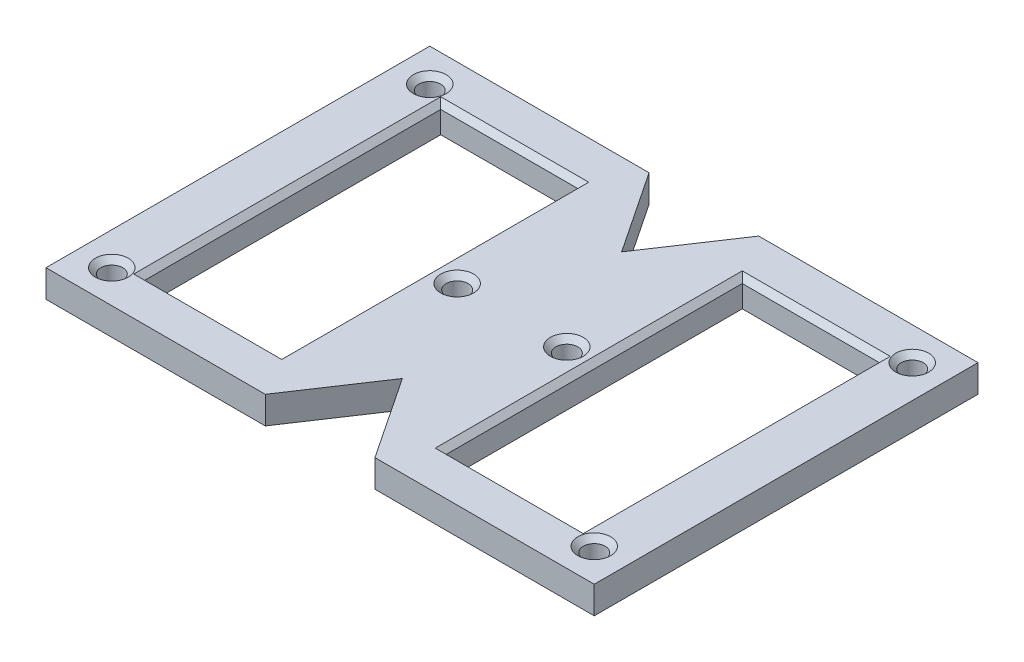
ISO-10303-21;
HEADER;
FILE_DESCRIPTION(('STEP AP214'),'2;1');
FILE_NAME('part.step','',(''),(''),'','','');
FILE_SCHEMA(('AUTOMOTIVE_DESIGN { 1 0 10303 214 1 1 1 1 }'));
ENDSEC;
DATA;
#1=APPLICATION_CONTEXT('core data for automotive mechanical design processes');
#2=APPLICATION_PROTOCOL_DEFINITION('international standard','automotive_design',2000,#1);
#3=PRODUCT_CONTEXT('',#1,'mechanical');
#4=PRODUCT('Part','Part','',(#3));
#5=PRODUCT_RELATED_PRODUCT_CATEGORY('part','',(#4));
#6=PRODUCT_DEFINITION_FORMATION('','',#4);
#7=PRODUCT_DEFINITION_CONTEXT('part definition',#1,'design');
#8=PRODUCT_DEFINITION('design','',#6,#7);
#9=PRODUCT_DEFINITION_SHAPE('','',#8);
#10=(LENGTH_UNIT() NAMED_UNIT(*) SI_UNIT(.MILLI.,.METRE.));
#11=(NAMED_UNIT(*) PLANE_ANGLE_UNIT() SI_UNIT($,.RADIAN.));
#12=(NAMED_UNIT(*) SI_UNIT($,.STERADIAN.) SOLID_ANGLE_UNIT());
#13=UNCERTAINTY_MEASURE_WITH_UNIT(LENGTH_MEASURE(1.E-05),#10,'distance_accuracy_value','');
#14=(GEOMETRIC_REPRESENTATION_CONTEXT(3) GLOBAL_UNCERTAINTY_ASSIGNED_CONTEXT((#13)) GLOBAL_UNIT_ASSIGNED_CONTEXT((#10,
#11,#12)) REPRESENTATION_CONTEXT('',''));
#15=CARTESIAN_POINT('',(0.,0.,0.));
#16=DIRECTION('',(0.,0.,1.));
#17=DIRECTION('',(1.,0.,0.));
#18=AXIS2_PLACEMENT_3D('',#15,#16,#17);
#19=CARTESIAN_POINT('',(50.,5.,35.));
#20=DIRECTION('',(0.,0.,-1.));
#21=DIRECTION('',(-1.,0.,0.));
#22=AXIS2_PLACEMENT_3D('',#19,#20,#21);
#23=PLANE('',#22);
#24=DIRECTION('',(0.,1.,0.));
#25=VECTOR('',#24,1.);
#26=CARTESIAN_POINT('',(-10.,0.,35.));
#27=LINE('',#26,#25);
#28=CARTESIAN_POINT('',(-10.,0.,35.));
#29=VERTEX_POINT('',#28);
#30=CARTESIAN_POINT('',(-10.,5.,35.));
#31=VERTEX_POINT('',#30);
#32=EDGE_CURVE('E389',#29,#31,#27,.T.);
#33=ORIENTED_EDGE('',*,*,#32,.T.);
#34=DIRECTION('',(1.,0.,0.));
#35=VECTOR('',#34,1.);
#36=CARTESIAN_POINT('',(50.,5.,35.));
#37=LINE('',#36,#35);
#38=CARTESIAN_POINT('',(-50.,5.,35.));
#39=VERTEX_POINT('',#38);
#40=EDGE_CURVE('E363',#39,#31,#37,.T.);
#41=ORIENTED_EDGE('',*,*,#40,.F.);
#42=DIRECTION('',(0.,-1.,0.));
#43=VECTOR('',#42,1.);
#44=CARTESIAN_POINT('',(-50.,5.,35.));
#45=LINE('',#44,#43);
#46=CARTESIAN_POINT('',(-50.,0.,35.));
#47=VERTEX_POINT('',#46);
#48=EDGE_CURVE('E235',#39,#47,#45,.T.);
#49=ORIENTED_EDGE('',*,*,#48,.T.);
#50=DIRECTION('',(1.,0.,0.));
#51=VECTOR('',#50,1.);
#52=CARTESIAN_POINT('',(50.,0.,35.));
#53=LINE('',#52,#51);
#54=EDGE_CURVE('E211',#47,#29,#53,.T.);
#55=ORIENTED_EDGE('',*,*,#54,.T.);
#56=EDGE_LOOP('',(#33,#41,#49,#55));
#57=FACE_BOUND('',#56,.T.);
#58=ADVANCED_FACE('F35',(#57),#23,.F.);
#59=DIRECTION('',(0.,1.,0.));
#60=VECTOR('',#59,1.);
#61=CARTESIAN_POINT('',(10.,0.,35.));
#62=LINE('',#61,#60);
#63=CARTESIAN_POINT('',(10.,0.,35.));
#64=VERTEX_POINT('',#63);
#65=CARTESIAN_POINT('',(10.,5.,35.));
#66=VERTEX_POINT('',#65);
#67=EDGE_CURVE('E189',#64,#66,#62,.T.);
#68=ORIENTED_EDGE('',*,*,#67,.F.);
#69=CARTESIAN_POINT('',(50.,0.,35.));
#70=VERTEX_POINT('',#69);
#71=EDGE_CURVE('E203',#64,#70,#53,.T.);
#72=ORIENTED_EDGE('',*,*,#71,.T.);
#73=DIRECTION('',(0.,-1.,0.));
#74=VECTOR('',#73,1.);
#75=CARTESIAN_POINT('',(50.,5.,35.));
#76=LINE('',#75,#74);
#77=CARTESIAN_POINT('',(50.,5.,35.));
#78=VERTEX_POINT('',#77);
#79=EDGE_CURVE('E233',#78,#70,#76,.T.);
#80=ORIENTED_EDGE('',*,*,#79,.F.);
#81=EDGE_CURVE('E205',#66,#78,#37,.T.);
#82=ORIENTED_EDGE('',*,*,#81,.F.);
#83=EDGE_LOOP('',(#68,#72,#80,#82));
#84=FACE_BOUND('',#83,.T.);
#85=ADVANCED_FACE('F201',(#84),#23,.F.);
#86=CARTESIAN_POINT('',(0.,5.,0.));
#87=DIRECTION('',(0.,1.,0.));
#88=DIRECTION('',(0.,0.,1.));
#89=AXIS2_PLACEMENT_3D('',#86,#87,#88);
#90=PLANE('',#89);
#91=CARTESIAN_POINT('',(44.,5.,29.));
#92=DIRECTION('',(0.,1.,0.));
#93=DIRECTION('',(0.,0.,1.));
#94=AXIS2_PLACEMENT_3D('',#91,#92,#93);
#95=CIRCLE('',#94,3.00000000000004);
#96=CARTESIAN_POINT('',(44.,5.,32.0000000000001));
#97=VERTEX_POINT('',#96);
#98=EDGE_CURVE('E274',#97,#97,#95,.F.);
#99=ORIENTED_EDGE('',*,*,#98,.T.);
#100=EDGE_LOOP('',(#99));
#101=FACE_BOUND('',#100,.T.);
#102=CARTESIAN_POINT('',(44.,5.,-29.));
#103=DIRECTION('',(0.,1.,0.));
#104=DIRECTION('',(0.,0.,1.));
#105=AXIS2_PLACEMENT_3D('',#102,#103,#104);
#106=CIRCLE('',#105,3.00000000000004);
#107=CARTESIAN_POINT('',(44.,5.,-26.));
#108=VERTEX_POINT('',#107);
#109=EDGE_CURVE('E271',#108,#108,#106,.F.);
#110=ORIENTED_EDGE('',*,*,#109,.T.);
#111=EDGE_LOOP('',(#110));
#112=FACE_BOUND('',#111,.T.);
#113=CARTESIAN_POINT('',(10.,5.,0.));
#114=DIRECTION('',(0.,1.,0.));
#115=DIRECTION('',(0.,0.,1.));
#116=AXIS2_PLACEMENT_3D('',#113,#114,#115);
#117=CIRCLE('',#116,3.00000000000004);
#118=CARTESIAN_POINT('',(10.,5.,3.00000000000004));
#119=VERTEX_POINT('',#118);
#120=EDGE_CURVE('E268',#119,#119,#117,.F.);
#121=ORIENTED_EDGE('',*,*,#120,.T.);
#122=EDGE_LOOP('',(#121));
#123=FACE_BOUND('',#122,.T.);
#124=CARTESIAN_POINT('',(-10.,5.,0.));
#125=DIRECTION('',(0.,1.,0.));
#126=DIRECTION('',(0.,0.,1.));
#127=AXIS2_PLACEMENT_3D('',#124,#125,#126);
#128=CIRCLE('',#127,3.00000000000004);
#129=CARTESIAN_POINT('',(-10.,5.,3.00000000000004));
#130=VERTEX_POINT('',#129);
#131=EDGE_CURVE('E265',#130,#130,#128,.F.);
#132=ORIENTED_EDGE('',*,*,#131,.T.);
#133=EDGE_LOOP('',(#132));
#134=FACE_BOUND('',#133,.T.);
#135=CARTESIAN_POINT('',(-44.,5.,29.));
#136=DIRECTION('',(0.,1.,0.));
#137=DIRECTION('',(0.,0.,1.));
#138=AXIS2_PLACEMENT_3D('',#135,#136,#137);
#139=CIRCLE('',#138,3.00000000000004);
#140=CARTESIAN_POINT('',(-44.,5.,32.0000000000001));
#141=VERTEX_POINT('',#140);
#142=EDGE_CURVE('E262',#141,#141,#139,.F.);
#143=ORIENTED_EDGE('',*,*,#142,.T.);
#144=EDGE_LOOP('',(#143));
#145=FACE_BOUND('',#144,.T.);
#146=CARTESIAN_POINT('',(-44.,5.,-29.));
#147=DIRECTION('',(0.,1.,0.));
#148=DIRECTION('',(0.,0.,1.));
#149=AXIS2_PLACEMENT_3D('',#146,#147,#148);
#150=CIRCLE('',#149,3.00000000000004);
#151=CARTESIAN_POINT('',(-44.,5.,-26.));
#152=VERTEX_POINT('',#151);
#153=EDGE_CURVE('E259',#152,#152,#150,.F.);
#154=ORIENTED_EDGE('',*,*,#153,.T.);
#155=EDGE_LOOP('',(#154));
#156=FACE_BOUND('',#155,.T.);
#157=DIRECTION('',(0.,0.,1.));
#158=VECTOR('',#157,1.);
#159=CARTESIAN_POINT('',(41.,5.,27.));
#160=LINE('',#159,#158);
#161=CARTESIAN_POINT('',(41.,5.,-28.));
#162=VERTEX_POINT('',#161);
#163=CARTESIAN_POINT('',(41.,5.,28.));
#164=VERTEX_POINT('',#163);
#165=EDGE_CURVE('E254',#162,#164,#160,.T.);
#166=ORIENTED_EDGE('',*,*,#165,.T.);
#167=DIRECTION('',(-1.,0.,0.));
#168=VECTOR('',#167,1.);
#169=CARTESIAN_POINT('',(15.,5.,28.));
#170=LINE('',#169,#168);
#171=CARTESIAN_POINT('',(14.,5.,28.));
#172=VERTEX_POINT('',#171);
#173=EDGE_CURVE('E256',#164,#172,#170,.T.);
#174=ORIENTED_EDGE('',*,*,#173,.T.);
#175=DIRECTION('',(0.,0.,-1.));
#176=VECTOR('',#175,1.);
#177=CARTESIAN_POINT('',(14.,5.,-27.));
#178=LINE('',#177,#176);
#179=CARTESIAN_POINT('',(14.,5.,-28.));
#180=VERTEX_POINT('',#179);
#181=EDGE_CURVE('E252',#172,#180,#178,.T.);
#182=ORIENTED_EDGE('',*,*,#181,.T.);
#183=DIRECTION('',(1.,0.,0.));
#184=VECTOR('',#183,1.);
#185=CARTESIAN_POINT('',(40.,5.,-28.));
#186=LINE('',#185,#184);
#187=EDGE_CURVE('E250',#180,#162,#186,.T.);
#188=ORIENTED_EDGE('',*,*,#187,.T.);
#189=EDGE_LOOP('',(#166,#174,#182,#188));
#190=FACE_BOUND('',#189,.T.);
#191=DIRECTION('',(0.,0.,1.));
#192=VECTOR('',#191,1.);
#193=CARTESIAN_POINT('',(-14.,5.,27.));
#194=LINE('',#193,#192);
#195=CARTESIAN_POINT('',(-14.,5.,-28.));
#196=VERTEX_POINT('',#195);
#197=CARTESIAN_POINT('',(-14.,5.,28.));
#198=VERTEX_POINT('',#197);
#199=EDGE_CURVE('E245',#196,#198,#194,.T.);
#200=ORIENTED_EDGE('',*,*,#199,.T.);
#201=DIRECTION('',(-1.,0.,0.));
#202=VECTOR('',#201,1.);
#203=CARTESIAN_POINT('',(-40.,5.,28.));
#204=LINE('',#203,#202);
#205=CARTESIAN_POINT('',(-41.,5.,28.));
#206=VERTEX_POINT('',#205);
#207=EDGE_CURVE('E247',#198,#206,#204,.T.);
#208=ORIENTED_EDGE('',*,*,#207,.T.);
#209=DIRECTION('',(0.,0.,-1.));
#210=VECTOR('',#209,1.);
#211=CARTESIAN_POINT('',(-41.,5.,-27.));
#212=LINE('',#211,#210);
#213=CARTESIAN_POINT('',(-41.,5.,-28.));
#214=VERTEX_POINT('',#213);
#215=EDGE_CURVE('E241',#206,#214,#212,.T.);
#216=ORIENTED_EDGE('',*,*,#215,.T.);
#217=DIRECTION('',(1.,0.,0.));
#218=VECTOR('',#217,1.);
#219=CARTESIAN_POINT('',(-15.,5.,-28.));
#220=LINE('',#219,#218);
#221=EDGE_CURVE('E243',#214,#196,#220,.T.);
#222=ORIENTED_EDGE('',*,*,#221,.T.);
#223=EDGE_LOOP('',(#200,#208,#216,#222));
#224=FACE_BOUND('',#223,.T.);
#225=ORIENTED_EDGE('',*,*,#40,.T.);
#226=DIRECTION('',(0.554700196225229,0.,-0.832050294337844));
#227=VECTOR('',#226,1.);
#228=CARTESIAN_POINT('',(-10.,5.,35.));
#229=LINE('',#228,#227);
#230=CARTESIAN_POINT('',(0.,5.,20.));
#231=VERTEX_POINT('',#230);
#232=EDGE_CURVE('E197',#31,#231,#229,.T.);
#233=ORIENTED_EDGE('',*,*,#232,.T.);
#234=DIRECTION('',(0.554700196225229,0.,0.832050294337844));
#235=VECTOR('',#234,1.);
#236=CARTESIAN_POINT('',(0.,5.,20.));
#237=LINE('',#236,#235);
#238=EDGE_CURVE('E316',#231,#66,#237,.T.);
#239=ORIENTED_EDGE('',*,*,#238,.T.);
#240=ORIENTED_EDGE('',*,*,#81,.T.);
#241=DIRECTION('',(0.,0.,-1.));
#242=VECTOR('',#241,1.);
#243=CARTESIAN_POINT('',(50.,5.,35.));
#244=LINE('',#243,#242);
#245=CARTESIAN_POINT('',(50.,5.,-35.));
#246=VERTEX_POINT('',#245);
#247=EDGE_CURVE('E368',#78,#246,#244,.T.);
#248=ORIENTED_EDGE('',*,*,#247,.T.);
#249=DIRECTION('',(-1.,0.,0.));
#250=VECTOR('',#249,1.);
#251=CARTESIAN_POINT('',(50.,5.,-35.));
#252=LINE('',#251,#250);
#253=CARTESIAN_POINT('',(10.,5.,-35.));
#254=VERTEX_POINT('',#253);
#255=EDGE_CURVE('E230',#246,#254,#252,.T.);
#256=ORIENTED_EDGE('',*,*,#255,.T.);
#257=DIRECTION('',(0.554700196225229,0.,-0.832050294337844));
#258=VECTOR('',#257,1.);
#259=CARTESIAN_POINT('',(0.,5.,-20.));
#260=LINE('',#259,#258);
#261=CARTESIAN_POINT('',(0.,5.,-20.));
#262=VERTEX_POINT('',#261);
#263=EDGE_CURVE('E401',#262,#254,#260,.T.);
#264=ORIENTED_EDGE('',*,*,#263,.F.);
#265=DIRECTION('',(0.554700196225229,0.,0.832050294337844));
#266=VECTOR('',#265,1.);
#267=CARTESIAN_POINT('',(-10.,5.,-35.));
#268=LINE('',#267,#266);
#269=CARTESIAN_POINT('',(-10.,5.,-35.));
#270=VERTEX_POINT('',#269);
#271=EDGE_CURVE('E381',#270,#262,#268,.T.);
#272=ORIENTED_EDGE('',*,*,#271,.F.);
#273=CARTESIAN_POINT('',(-50.,5.,-35.));
#274=VERTEX_POINT('',#273);
#275=EDGE_CURVE('E370',#270,#274,#252,.T.);
#276=ORIENTED_EDGE('',*,*,#275,.T.);
#277=DIRECTION('',(0.,0.,1.));
#278=VECTOR('',#277,1.);
#279=CARTESIAN_POINT('',(-50.,5.,35.));
#280=LINE('',#279,#278);
#281=EDGE_CURVE('E225',#274,#39,#280,.T.);
#282=ORIENTED_EDGE('',*,*,#281,.T.);
#283=EDGE_LOOP('',(#225,#233,#239,#240,#248,#256,#264,#272,#276,#282));
#284=FACE_BOUND('',#283,.T.);
#285=ADVANCED_FACE('F355',(#101,#112,#123,#134,#145,#156,#190,#224,#284),#90,.T.);
#286=CARTESIAN_POINT('',(0.,0.,0.));
#287=DIRECTION('',(0.,1.,0.));
#288=DIRECTION('',(0.,0.,1.));
#289=AXIS2_PLACEMENT_3D('',#286,#287,#288);
#290=PLANE('',#289);
#291=CARTESIAN_POINT('',(-44.,0.,-29.));
#292=DIRECTION('',(0.,1.,0.));
#293=DIRECTION('',(0.,0.,1.));
#294=AXIS2_PLACEMENT_3D('',#291,#292,#293);
#295=CIRCLE('',#294,2.);
#296=CARTESIAN_POINT('',(-44.,0.,-27.));
#297=VERTEX_POINT('',#296);
#298=EDGE_CURVE('E216',#297,#297,#295,.T.);
#299=ORIENTED_EDGE('',*,*,#298,.T.);
#300=EDGE_LOOP('',(#299));
#301=FACE_BOUND('',#300,.T.);
#302=CARTESIAN_POINT('',(44.,0.,-29.));
#303=DIRECTION('',(0.,1.,0.));
#304=DIRECTION('',(0.,0.,1.));
#305=AXIS2_PLACEMENT_3D('',#302,#303,#304);
#306=CIRCLE('',#305,2.);
#307=CARTESIAN_POINT('',(44.,0.,-27.));
#308=VERTEX_POINT('',#307);
#309=EDGE_CURVE('E453',#308,#308,#306,.T.);
#310=ORIENTED_EDGE('',*,*,#309,.T.);
#311=EDGE_LOOP('',(#310));
#312=FACE_BOUND('',#311,.T.);
#313=CARTESIAN_POINT('',(44.,0.,29.));
#314=DIRECTION('',(0.,1.,0.));
#315=DIRECTION('',(0.,0.,1.));
#316=AXIS2_PLACEMENT_3D('',#313,#314,#315);
#317=CIRCLE('',#316,2.);
#318=CARTESIAN_POINT('',(44.,0.,31.));
#319=VERTEX_POINT('',#318);
#320=EDGE_CURVE('E456',#319,#319,#317,.T.);
#321=ORIENTED_EDGE('',*,*,#320,.T.);
#322=EDGE_LOOP('',(#321));
#323=FACE_BOUND('',#322,.T.);
#324=CARTESIAN_POINT('',(-44.,0.,29.));
#325=DIRECTION('',(0.,1.,0.));
#326=DIRECTION('',(0.,0.,1.));
#327=AXIS2_PLACEMENT_3D('',#324,#325,#326);
#328=CIRCLE('',#327,2.);
#329=CARTESIAN_POINT('',(-44.,0.,31.));
#330=VERTEX_POINT('',#329);
#331=EDGE_CURVE('E450',#330,#330,#328,.T.);
#332=ORIENTED_EDGE('',*,*,#331,.T.);
#333=EDGE_LOOP('',(#332));
#334=FACE_BOUND('',#333,.T.);
#335=CARTESIAN_POINT('',(10.,0.,0.));
#336=DIRECTION('',(0.,1.,0.));
#337=DIRECTION('',(0.,0.,1.));
#338=AXIS2_PLACEMENT_3D('',#335,#336,#337);
#339=CIRCLE('',#338,2.);
#340=CARTESIAN_POINT('',(10.,0.,2.));
#341=VERTEX_POINT('',#340);
#342=EDGE_CURVE('E426',#341,#341,#339,.T.);
#343=ORIENTED_EDGE('',*,*,#342,.T.);
#344=EDGE_LOOP('',(#343));
#345=FACE_BOUND('',#344,.T.);
#346=CARTESIAN_POINT('',(-10.,0.,0.));
#347=DIRECTION('',(0.,1.,0.));
#348=DIRECTION('',(0.,0.,1.));
#349=AXIS2_PLACEMENT_3D('',#346,#347,#348);
#350=CIRCLE('',#349,2.);
#351=CARTESIAN_POINT('',(-10.,0.,2.));
#352=VERTEX_POINT('',#351);
#353=EDGE_CURVE('E447',#352,#352,#350,.T.);
#354=ORIENTED_EDGE('',*,*,#353,.T.);
#355=EDGE_LOOP('',(#354));
#356=FACE_BOUND('',#355,.T.);
#357=DIRECTION('',(-1.,0.,0.));
#358=VECTOR('',#357,1.);
#359=CARTESIAN_POINT('',(15.,0.,27.));
#360=LINE('',#359,#358);
#361=CARTESIAN_POINT('',(40.,0.,27.));
#362=VERTEX_POINT('',#361);
#363=CARTESIAN_POINT('',(15.,0.,27.));
#364=VERTEX_POINT('',#363);
#365=EDGE_CURVE('E431',#362,#364,#360,.T.);
#366=ORIENTED_EDGE('',*,*,#365,.F.);
#367=DIRECTION('',(0.,0.,1.));
#368=VECTOR('',#367,1.);
#369=CARTESIAN_POINT('',(40.,0.,-27.));
#370=LINE('',#369,#368);
#371=CARTESIAN_POINT('',(40.,0.,-27.));
#372=VERTEX_POINT('',#371);
#373=EDGE_CURVE('E410',#372,#362,#370,.T.);
#374=ORIENTED_EDGE('',*,*,#373,.F.);
#375=DIRECTION('',(1.,0.,0.));
#376=VECTOR('',#375,1.);
#377=CARTESIAN_POINT('',(15.,0.,-27.));
#378=LINE('',#377,#376);
#379=CARTESIAN_POINT('',(15.,0.,-27.));
#380=VERTEX_POINT('',#379);
#381=EDGE_CURVE('E437',#380,#372,#378,.T.);
#382=ORIENTED_EDGE('',*,*,#381,.F.);
#383=DIRECTION('',(0.,0.,-1.));
#384=VECTOR('',#383,1.);
#385=CARTESIAN_POINT('',(15.,0.,-27.));
#386=LINE('',#385,#384);
#387=EDGE_CURVE('E434',#364,#380,#386,.T.);
#388=ORIENTED_EDGE('',*,*,#387,.F.);
#389=EDGE_LOOP('',(#366,#374,#382,#388));
#390=FACE_BOUND('',#389,.T.);
#391=DIRECTION('',(-1.,0.,0.));
#392=VECTOR('',#391,1.);
#393=CARTESIAN_POINT('',(-40.,0.,27.));
#394=LINE('',#393,#392);
#395=CARTESIAN_POINT('',(-15.,0.,27.));
#396=VERTEX_POINT('',#395);
#397=CARTESIAN_POINT('',(-40.,0.,27.));
#398=VERTEX_POINT('',#397);
#399=EDGE_CURVE('E347',#396,#398,#394,.T.);
#400=ORIENTED_EDGE('',*,*,#399,.F.);
#401=DIRECTION('',(0.,0.,1.));
#402=VECTOR('',#401,1.);
#403=CARTESIAN_POINT('',(-15.,0.,-27.));
#404=LINE('',#403,#402);
#405=CARTESIAN_POINT('',(-15.,0.,-27.));
#406=VERTEX_POINT('',#405);
#407=EDGE_CURVE('E414',#406,#396,#404,.T.);
#408=ORIENTED_EDGE('',*,*,#407,.F.);
#409=DIRECTION('',(1.,0.,0.));
#410=VECTOR('',#409,1.);
#411=CARTESIAN_POINT('',(-40.,0.,-27.));
#412=LINE('',#411,#410);
#413=CARTESIAN_POINT('',(-40.,0.,-27.));
#414=VERTEX_POINT('',#413);
#415=EDGE_CURVE('E421',#414,#406,#412,.T.);
#416=ORIENTED_EDGE('',*,*,#415,.F.);
#417=DIRECTION('',(0.,0.,-1.));
#418=VECTOR('',#417,1.);
#419=CARTESIAN_POINT('',(-40.,0.,-27.));
#420=LINE('',#419,#418);
#421=EDGE_CURVE('E419',#398,#414,#420,.T.);
#422=ORIENTED_EDGE('',*,*,#421,.F.);
#423=EDGE_LOOP('',(#400,#408,#416,#422));
#424=FACE_BOUND('',#423,.T.);
#425=DIRECTION('',(0.554700196225229,0.,-0.832050294337844));
#426=VECTOR('',#425,1.);
#427=CARTESIAN_POINT('',(-10.,0.,35.));
#428=LINE('',#427,#426);
#429=CARTESIAN_POINT('',(0.,0.,20.));
#430=VERTEX_POINT('',#429);
#431=EDGE_CURVE('E196',#29,#430,#428,.T.);
#432=ORIENTED_EDGE('',*,*,#431,.F.);
#433=ORIENTED_EDGE('',*,*,#54,.F.);
#434=DIRECTION('',(0.,0.,1.));
#435=VECTOR('',#434,1.);
#436=CARTESIAN_POINT('',(-50.,0.,35.));
#437=LINE('',#436,#435);
#438=CARTESIAN_POINT('',(-50.,0.,-35.));
#439=VERTEX_POINT('',#438);
#440=EDGE_CURVE('E212',#439,#47,#437,.T.);
#441=ORIENTED_EDGE('',*,*,#440,.F.);
#442=DIRECTION('',(-1.,0.,0.));
#443=VECTOR('',#442,1.);
#444=CARTESIAN_POINT('',(50.,0.,-35.));
#445=LINE('',#444,#443);
#446=CARTESIAN_POINT('',(-10.,0.,-35.));
#447=VERTEX_POINT('',#446);
#448=EDGE_CURVE('E221',#447,#439,#445,.T.);
#449=ORIENTED_EDGE('',*,*,#448,.F.);
#450=DIRECTION('',(0.554700196225229,0.,0.832050294337844));
#451=VECTOR('',#450,1.);
#452=CARTESIAN_POINT('',(-10.,0.,-35.));
#453=LINE('',#452,#451);
#454=CARTESIAN_POINT('',(0.,0.,-20.));
#455=VERTEX_POINT('',#454);
#456=EDGE_CURVE('E397',#447,#455,#453,.T.);
#457=ORIENTED_EDGE('',*,*,#456,.T.);
#458=DIRECTION('',(0.554700196225229,0.,-0.832050294337844));
#459=VECTOR('',#458,1.);
#460=CARTESIAN_POINT('',(0.,0.,-20.));
#461=LINE('',#460,#459);
#462=CARTESIAN_POINT('',(10.,0.,-35.));
#463=VERTEX_POINT('',#462);
#464=EDGE_CURVE('E400',#455,#463,#461,.T.);
#465=ORIENTED_EDGE('',*,*,#464,.T.);
#466=CARTESIAN_POINT('',(50.,0.,-35.));
#467=VERTEX_POINT('',#466);
#468=EDGE_CURVE('E222',#467,#463,#445,.T.);
#469=ORIENTED_EDGE('',*,*,#468,.F.);
#470=DIRECTION('',(0.,0.,-1.));
#471=VECTOR('',#470,1.);
#472=CARTESIAN_POINT('',(50.,0.,35.));
#473=LINE('',#472,#471);
#474=EDGE_CURVE('E210',#70,#467,#473,.T.);
#475=ORIENTED_EDGE('',*,*,#474,.F.);
#476=ORIENTED_EDGE('',*,*,#71,.F.);
#477=DIRECTION('',(0.554700196225229,0.,0.832050294337844));
#478=VECTOR('',#477,1.);
#479=CARTESIAN_POINT('',(0.,0.,20.));
#480=LINE('',#479,#478);
#481=EDGE_CURVE('E185',#430,#64,#480,.T.);
#482=ORIENTED_EDGE('',*,*,#481,.F.);
#483=EDGE_LOOP('',(#432,#433,#441,#449,#457,#465,#469,#475,#476,#482));
#484=FACE_BOUND('',#483,.T.);
#485=ADVANCED_FACE('F208',(#301,#312,#323,#334,#345,#356,#390,#424,#484),#290,.F.);
#486=CARTESIAN_POINT('',(50.,5.,-35.));
#487=DIRECTION('',(0.,0.,1.));
#488=DIRECTION('',(1.,0.,0.));
#489=AXIS2_PLACEMENT_3D('',#486,#487,#488);
#490=PLANE('',#489);
#491=ORIENTED_EDGE('',*,*,#468,.T.);
#492=DIRECTION('',(0.,1.,0.));
#493=VECTOR('',#492,1.);
#494=CARTESIAN_POINT('',(10.,0.,-35.));
#495=LINE('',#494,#493);
#496=EDGE_CURVE('E407',#463,#254,#495,.T.);
#497=ORIENTED_EDGE('',*,*,#496,.T.);
#498=ORIENTED_EDGE('',*,*,#255,.F.);
#499=DIRECTION('',(0.,-1.,0.));
#500=VECTOR('',#499,1.);
#501=CARTESIAN_POINT('',(50.,5.,-35.));
#502=LINE('',#501,#500);
#503=EDGE_CURVE('E229',#246,#467,#502,.T.);
#504=ORIENTED_EDGE('',*,*,#503,.T.);
#505=EDGE_LOOP('',(#491,#497,#498,#504));
#506=FACE_BOUND('',#505,.T.);
#507=ADVANCED_FACE('F479',(#506),#490,.F.);
#508=CARTESIAN_POINT('',(-50.,5.,35.));
#509=DIRECTION('',(1.,0.,0.));
#510=DIRECTION('',(0.,0.,-1.));
#511=AXIS2_PLACEMENT_3D('',#508,#509,#510);
#512=PLANE('',#511);
#513=ORIENTED_EDGE('',*,*,#440,.T.);
#514=ORIENTED_EDGE('',*,*,#48,.F.);
#515=ORIENTED_EDGE('',*,*,#281,.F.);
#516=DIRECTION('',(0.,-1.,0.));
#517=VECTOR('',#516,1.);
#518=CARTESIAN_POINT('',(-50.,5.,-35.));
#519=LINE('',#518,#517);
#520=EDGE_CURVE('E226',#274,#439,#519,.T.);
#521=ORIENTED_EDGE('',*,*,#520,.T.);
#522=EDGE_LOOP('',(#513,#514,#515,#521));
#523=FACE_BOUND('',#522,.T.);
#524=ADVANCED_FACE('F388',(#523),#512,.F.);
#525=CARTESIAN_POINT('',(50.,5.,35.));
#526=DIRECTION('',(-1.,0.,0.));
#527=DIRECTION('',(0.,0.,1.));
#528=AXIS2_PLACEMENT_3D('',#525,#526,#527);
#529=PLANE('',#528);
#530=ORIENTED_EDGE('',*,*,#474,.T.);
#531=ORIENTED_EDGE('',*,*,#503,.F.);
#532=ORIENTED_EDGE('',*,*,#247,.F.);
#533=ORIENTED_EDGE('',*,*,#79,.T.);
#534=EDGE_LOOP('',(#530,#531,#532,#533));
#535=FACE_BOUND('',#534,.T.);
#536=ADVANCED_FACE('F477',(#535),#529,.F.);
#537=ORIENTED_EDGE('',*,*,#275,.F.);
#538=DIRECTION('',(0.,1.,0.));
#539=VECTOR('',#538,1.);
#540=CARTESIAN_POINT('',(-10.,0.,-35.));
#541=LINE('',#540,#539);
#542=EDGE_CURVE('E404',#447,#270,#541,.T.);
#543=ORIENTED_EDGE('',*,*,#542,.F.);
#544=ORIENTED_EDGE('',*,*,#448,.T.);
#545=ORIENTED_EDGE('',*,*,#520,.F.);
#546=EDGE_LOOP('',(#537,#543,#544,#545));
#547=FACE_BOUND('',#546,.T.);
#548=ADVANCED_FACE('F384',(#547),#490,.F.);
#549=CARTESIAN_POINT('',(-44.,0.,-29.));
#550=DIRECTION('',(0.,1.,0.));
#551=DIRECTION('',(0.,0.,1.));
#552=AXIS2_PLACEMENT_3D('',#549,#550,#551);
#553=CYLINDRICAL_SURFACE('',#552,2.);
#554=CARTESIAN_POINT('',(-44.,3.99999999999997,-29.));
#555=DIRECTION('',(0.,1.,0.));
#556=DIRECTION('',(0.,0.,1.));
#557=AXIS2_PLACEMENT_3D('',#554,#555,#556);
#558=CIRCLE('',#557,2.);
#559=CARTESIAN_POINT('',(-44.,3.99999999999997,-27.));
#560=VERTEX_POINT('',#559);
#561=EDGE_CURVE('E289',#560,#560,#558,.T.);
#562=ORIENTED_EDGE('',*,*,#561,.T.);
#563=EDGE_LOOP('',(#562));
#564=FACE_BOUND('',#563,.T.);
#565=ORIENTED_EDGE('',*,*,#298,.F.);
#566=EDGE_LOOP('',(#565));
#567=FACE_BOUND('',#566,.T.);
#568=ADVANCED_FACE('F465',(#564,#567),#553,.F.);
#569=CARTESIAN_POINT('',(44.,0.,-29.));
#570=DIRECTION('',(0.,1.,0.));
#571=DIRECTION('',(0.,0.,1.));
#572=AXIS2_PLACEMENT_3D('',#569,#570,#571);
#573=CYLINDRICAL_SURFACE('',#572,2.);
#574=CARTESIAN_POINT('',(44.,3.99999999999997,-29.));
#575=DIRECTION('',(0.,1.,0.));
#576=DIRECTION('',(0.,0.,1.));
#577=AXIS2_PLACEMENT_3D('',#574,#575,#576);
#578=CIRCLE('',#577,2.);
#579=CARTESIAN_POINT('',(44.,3.99999999999997,-27.));
#580=VERTEX_POINT('',#579);
#581=EDGE_CURVE('E277',#580,#580,#578,.T.);
#582=ORIENTED_EDGE('',*,*,#581,.T.);
#583=EDGE_LOOP('',(#582));
#584=FACE_BOUND('',#583,.T.);
#585=ORIENTED_EDGE('',*,*,#309,.F.);
#586=EDGE_LOOP('',(#585));
#587=FACE_BOUND('',#586,.T.);
#588=ADVANCED_FACE('F467',(#584,#587),#573,.F.);
#589=CARTESIAN_POINT('',(44.,0.,29.));
#590=DIRECTION('',(0.,1.,0.));
#591=DIRECTION('',(0.,0.,1.));
#592=AXIS2_PLACEMENT_3D('',#589,#590,#591);
#593=CYLINDRICAL_SURFACE('',#592,2.);
#594=CARTESIAN_POINT('',(44.,3.99999999999997,29.));
#595=DIRECTION('',(0.,1.,0.));
#596=DIRECTION('',(0.,0.,1.));
#597=AXIS2_PLACEMENT_3D('',#594,#595,#596);
#598=CIRCLE('',#597,2.);
#599=CARTESIAN_POINT('',(44.,3.99999999999997,31.));
#600=VERTEX_POINT('',#599);
#601=EDGE_CURVE('E238',#600,#600,#598,.T.);
#602=ORIENTED_EDGE('',*,*,#601,.T.);
#603=EDGE_LOOP('',(#602));
#604=FACE_BOUND('',#603,.T.);
#605=ORIENTED_EDGE('',*,*,#320,.F.);
#606=EDGE_LOOP('',(#605));
#607=FACE_BOUND('',#606,.T.);
#608=ADVANCED_FACE('F474',(#604,#607),#593,.F.);
#609=CARTESIAN_POINT('',(-44.,0.,29.));
#610=DIRECTION('',(0.,1.,0.));
#611=DIRECTION('',(0.,0.,1.));
#612=AXIS2_PLACEMENT_3D('',#609,#610,#611);
#613=CYLINDRICAL_SURFACE('',#612,2.);
#614=CARTESIAN_POINT('',(-44.,3.99999999999997,29.));
#615=DIRECTION('',(0.,1.,0.));
#616=DIRECTION('',(0.,0.,1.));
#617=AXIS2_PLACEMENT_3D('',#614,#615,#616);
#618=CIRCLE('',#617,2.);
#619=CARTESIAN_POINT('',(-44.,3.99999999999997,31.));
#620=VERTEX_POINT('',#619);
#621=EDGE_CURVE('E286',#620,#620,#618,.T.);
#622=ORIENTED_EDGE('',*,*,#621,.T.);
#623=EDGE_LOOP('',(#622));
#624=FACE_BOUND('',#623,.T.);
#625=ORIENTED_EDGE('',*,*,#331,.F.);
#626=EDGE_LOOP('',(#625));
#627=FACE_BOUND('',#626,.T.);
#628=ADVANCED_FACE('F723',(#624,#627),#613,.F.);
#629=CARTESIAN_POINT('',(10.,0.,0.));
#630=DIRECTION('',(0.,1.,0.));
#631=DIRECTION('',(0.,0.,1.));
#632=AXIS2_PLACEMENT_3D('',#629,#630,#631);
#633=CYLINDRICAL_SURFACE('',#632,2.);
#634=CARTESIAN_POINT('',(10.,3.99999999999997,0.));
#635=DIRECTION('',(0.,1.,0.));
#636=DIRECTION('',(0.,0.,1.));
#637=AXIS2_PLACEMENT_3D('',#634,#635,#636);
#638=CIRCLE('',#637,2.);
#639=CARTESIAN_POINT('',(10.,3.99999999999997,2.));
#640=VERTEX_POINT('',#639);
#641=EDGE_CURVE('E280',#640,#640,#638,.T.);
#642=ORIENTED_EDGE('',*,*,#641,.T.);
#643=EDGE_LOOP('',(#642));
#644=FACE_BOUND('',#643,.T.);
#645=ORIENTED_EDGE('',*,*,#342,.F.);
#646=EDGE_LOOP('',(#645));
#647=FACE_BOUND('',#646,.T.);
#648=ADVANCED_FACE('F715',(#644,#647),#633,.F.);
#649=CARTESIAN_POINT('',(-10.,0.,0.));
#650=DIRECTION('',(0.,1.,0.));
#651=DIRECTION('',(0.,0.,1.));
#652=AXIS2_PLACEMENT_3D('',#649,#650,#651);
#653=CYLINDRICAL_SURFACE('',#652,2.);
#654=CARTESIAN_POINT('',(-10.,3.99999999999997,0.));
#655=DIRECTION('',(0.,1.,0.));
#656=DIRECTION('',(0.,0.,1.));
#657=AXIS2_PLACEMENT_3D('',#654,#655,#656);
#658=CIRCLE('',#657,2.);
#659=CARTESIAN_POINT('',(-10.,3.99999999999997,2.));
#660=VERTEX_POINT('',#659);
#661=EDGE_CURVE('E283',#660,#660,#658,.T.);
#662=ORIENTED_EDGE('',*,*,#661,.T.);
#663=EDGE_LOOP('',(#662));
#664=FACE_BOUND('',#663,.T.);
#665=ORIENTED_EDGE('',*,*,#353,.F.);
#666=EDGE_LOOP('',(#665));
#667=FACE_BOUND('',#666,.T.);
#668=ADVANCED_FACE('F707',(#664,#667),#653,.F.);
#669=CARTESIAN_POINT('',(40.,5.,-27.));
#670=DIRECTION('',(1.,0.,0.));
#671=DIRECTION('',(0.,0.,-1.));
#672=AXIS2_PLACEMENT_3D('',#669,#670,#671);
#673=PLANE('',#672);
#674=DIRECTION('',(0.,-1.,0.));
#675=VECTOR('',#674,1.);
#676=CARTESIAN_POINT('',(40.,5.,27.));
#677=LINE('',#676,#675);
#678=CARTESIAN_POINT('',(40.,4.,27.));
#679=VERTEX_POINT('',#678);
#680=EDGE_CURVE('E440',#679,#362,#677,.T.);
#681=ORIENTED_EDGE('',*,*,#680,.F.);
#682=DIRECTION('',(0.,0.,-1.));
#683=VECTOR('',#682,1.);
#684=CARTESIAN_POINT('',(40.,4.,-27.));
#685=LINE('',#684,#683);
#686=CARTESIAN_POINT('',(40.,4.,-27.));
#687=VERTEX_POINT('',#686);
#688=EDGE_CURVE('E295',#679,#687,#685,.T.);
#689=ORIENTED_EDGE('',*,*,#688,.T.);
#690=DIRECTION('',(0.,-1.,0.));
#691=VECTOR('',#690,1.);
#692=CARTESIAN_POINT('',(40.,5.,-27.));
#693=LINE('',#692,#691);
#694=EDGE_CURVE('E417',#687,#372,#693,.T.);
#695=ORIENTED_EDGE('',*,*,#694,.T.);
#696=ORIENTED_EDGE('',*,*,#373,.T.);
#697=EDGE_LOOP('',(#681,#689,#695,#696));
#698=FACE_BOUND('',#697,.T.);
#699=ADVANCED_FACE('F699',(#698),#673,.F.);
#700=CARTESIAN_POINT('',(15.,5.,-27.));
#701=DIRECTION('',(0.,0.,-1.));
#702=DIRECTION('',(-1.,0.,0.));
#703=AXIS2_PLACEMENT_3D('',#700,#701,#702);
#704=PLANE('',#703);
#705=ORIENTED_EDGE('',*,*,#694,.F.);
#706=DIRECTION('',(-1.,0.,0.));
#707=VECTOR('',#706,1.);
#708=CARTESIAN_POINT('',(15.,4.,-27.));
#709=LINE('',#708,#707);
#710=CARTESIAN_POINT('',(15.,4.,-27.));
#711=VERTEX_POINT('',#710);
#712=EDGE_CURVE('E299',#687,#711,#709,.T.);
#713=ORIENTED_EDGE('',*,*,#712,.T.);
#714=DIRECTION('',(0.,-1.,0.));
#715=VECTOR('',#714,1.);
#716=CARTESIAN_POINT('',(15.,5.,-27.));
#717=LINE('',#716,#715);
#718=EDGE_CURVE('E442',#711,#380,#717,.T.);
#719=ORIENTED_EDGE('',*,*,#718,.T.);
#720=ORIENTED_EDGE('',*,*,#381,.T.);
#721=EDGE_LOOP('',(#705,#713,#719,#720));
#722=FACE_BOUND('',#721,.T.);
#723=ADVANCED_FACE('F691',(#722),#704,.F.);
#724=CARTESIAN_POINT('',(15.,5.,-27.));
#725=DIRECTION('',(-1.,0.,0.));
#726=DIRECTION('',(0.,0.,1.));
#727=AXIS2_PLACEMENT_3D('',#724,#725,#726);
#728=PLANE('',#727);
#729=ORIENTED_EDGE('',*,*,#718,.F.);
#730=DIRECTION('',(0.,0.,1.));
#731=VECTOR('',#730,1.);
#732=CARTESIAN_POINT('',(15.,4.,27.));
#733=LINE('',#732,#731);
#734=CARTESIAN_POINT('',(15.,4.,27.));
#735=VERTEX_POINT('',#734);
#736=EDGE_CURVE('E297',#711,#735,#733,.T.);
#737=ORIENTED_EDGE('',*,*,#736,.T.);
#738=DIRECTION('',(0.,-1.,0.));
#739=VECTOR('',#738,1.);
#740=CARTESIAN_POINT('',(15.,5.,27.));
#741=LINE('',#740,#739);
#742=EDGE_CURVE('E444',#735,#364,#741,.T.);
#743=ORIENTED_EDGE('',*,*,#742,.T.);
#744=ORIENTED_EDGE('',*,*,#387,.T.);
#745=EDGE_LOOP('',(#729,#737,#743,#744));
#746=FACE_BOUND('',#745,.T.);
#747=ADVANCED_FACE('F683',(#746),#728,.F.);
#748=CARTESIAN_POINT('',(15.,5.,27.));
#749=DIRECTION('',(0.,0.,1.));
#750=DIRECTION('',(1.,0.,0.));
#751=AXIS2_PLACEMENT_3D('',#748,#749,#750);
#752=PLANE('',#751);
#753=ORIENTED_EDGE('',*,*,#742,.F.);
#754=DIRECTION('',(1.,0.,0.));
#755=VECTOR('',#754,1.);
#756=CARTESIAN_POINT('',(40.,4.,27.));
#757=LINE('',#756,#755);
#758=EDGE_CURVE('E292',#735,#679,#757,.T.);
#759=ORIENTED_EDGE('',*,*,#758,.T.);
#760=ORIENTED_EDGE('',*,*,#680,.T.);
#761=ORIENTED_EDGE('',*,*,#365,.T.);
#762=EDGE_LOOP('',(#753,#759,#760,#761));
#763=FACE_BOUND('',#762,.T.);
#764=ADVANCED_FACE('F676',(#763),#752,.F.);
#765=CARTESIAN_POINT('',(-15.,5.,-27.));
#766=DIRECTION('',(1.,0.,0.));
#767=DIRECTION('',(0.,0.,-1.));
#768=AXIS2_PLACEMENT_3D('',#765,#766,#767);
#769=PLANE('',#768);
#770=DIRECTION('',(0.,-1.,0.));
#771=VECTOR('',#770,1.);
#772=CARTESIAN_POINT('',(-15.,5.,27.));
#773=LINE('',#772,#771);
#774=CARTESIAN_POINT('',(-15.,4.,27.));
#775=VERTEX_POINT('',#774);
#776=EDGE_CURVE('E349',#775,#396,#773,.T.);
#777=ORIENTED_EDGE('',*,*,#776,.F.);
#778=DIRECTION('',(0.,0.,-1.));
#779=VECTOR('',#778,1.);
#780=CARTESIAN_POINT('',(-15.,4.,-27.));
#781=LINE('',#780,#779);
#782=CARTESIAN_POINT('',(-15.,4.,-27.));
#783=VERTEX_POINT('',#782);
#784=EDGE_CURVE('E60',#775,#783,#781,.T.);
#785=ORIENTED_EDGE('',*,*,#784,.T.);
#786=DIRECTION('',(0.,-1.,0.));
#787=VECTOR('',#786,1.);
#788=CARTESIAN_POINT('',(-15.,5.,-27.));
#789=LINE('',#788,#787);
#790=EDGE_CURVE('E424',#783,#406,#789,.T.);
#791=ORIENTED_EDGE('',*,*,#790,.T.);
#792=ORIENTED_EDGE('',*,*,#407,.T.);
#793=EDGE_LOOP('',(#777,#785,#791,#792));
#794=FACE_BOUND('',#793,.T.);
#795=ADVANCED_FACE('F669',(#794),#769,.F.);
#796=CARTESIAN_POINT('',(-40.,5.,-27.));
#797=DIRECTION('',(0.,0.,-1.));
#798=DIRECTION('',(-1.,0.,0.));
#799=AXIS2_PLACEMENT_3D('',#796,#797,#798);
#800=PLANE('',#799);
#801=ORIENTED_EDGE('',*,*,#790,.F.);
#802=DIRECTION('',(-1.,0.,0.));
#803=VECTOR('',#802,1.);
#804=CARTESIAN_POINT('',(-40.,4.,-27.));
#805=LINE('',#804,#803);
#806=CARTESIAN_POINT('',(-40.,4.,-27.));
#807=VERTEX_POINT('',#806);
#808=EDGE_CURVE('E45',#783,#807,#805,.T.);
#809=ORIENTED_EDGE('',*,*,#808,.T.);
#810=DIRECTION('',(0.,-1.,0.));
#811=VECTOR('',#810,1.);
#812=CARTESIAN_POINT('',(-40.,5.,-27.));
#813=LINE('',#812,#811);
#814=EDGE_CURVE('E342',#807,#414,#813,.T.);
#815=ORIENTED_EDGE('',*,*,#814,.T.);
#816=ORIENTED_EDGE('',*,*,#415,.T.);
#817=EDGE_LOOP('',(#801,#809,#815,#816));
#818=FACE_BOUND('',#817,.T.);
#819=ADVANCED_FACE('F662',(#818),#800,.F.);
#820=CARTESIAN_POINT('',(-40.,5.,-27.));
#821=DIRECTION('',(-1.,0.,0.));
#822=DIRECTION('',(0.,0.,1.));
#823=AXIS2_PLACEMENT_3D('',#820,#821,#822);
#824=PLANE('',#823);
#825=ORIENTED_EDGE('',*,*,#814,.F.);
#826=DIRECTION('',(0.,0.,1.));
#827=VECTOR('',#826,1.);
#828=CARTESIAN_POINT('',(-40.,4.,27.));
#829=LINE('',#828,#827);
#830=CARTESIAN_POINT('',(-40.,4.,27.));
#831=VERTEX_POINT('',#830);
#832=EDGE_CURVE('E11',#807,#831,#829,.T.);
#833=ORIENTED_EDGE('',*,*,#832,.T.);
#834=DIRECTION('',(0.,-1.,0.));
#835=VECTOR('',#834,1.);
#836=CARTESIAN_POINT('',(-40.,5.,27.));
#837=LINE('',#836,#835);
#838=EDGE_CURVE('E340',#831,#398,#837,.T.);
#839=ORIENTED_EDGE('',*,*,#838,.T.);
#840=ORIENTED_EDGE('',*,*,#421,.T.);
#841=EDGE_LOOP('',(#825,#833,#839,#840));
#842=FACE_BOUND('',#841,.T.);
#843=ADVANCED_FACE('F338',(#842),#824,.F.);
#844=CARTESIAN_POINT('',(-40.,5.,27.));
#845=DIRECTION('',(0.,0.,1.));
#846=DIRECTION('',(1.,0.,0.));
#847=AXIS2_PLACEMENT_3D('',#844,#845,#846);
#848=PLANE('',#847);
#849=ORIENTED_EDGE('',*,*,#838,.F.);
#850=DIRECTION('',(1.,0.,0.));
#851=VECTOR('',#850,1.);
#852=CARTESIAN_POINT('',(-15.,4.,27.));
#853=LINE('',#852,#851);
#854=EDGE_CURVE('E301',#831,#775,#853,.T.);
#855=ORIENTED_EDGE('',*,*,#854,.T.);
#856=ORIENTED_EDGE('',*,*,#776,.T.);
#857=ORIENTED_EDGE('',*,*,#399,.T.);
#858=EDGE_LOOP('',(#849,#855,#856,#857));
#859=FACE_BOUND('',#858,.T.);
#860=ADVANCED_FACE('F345',(#859),#848,.F.);
#861=CARTESIAN_POINT('',(0.,0.,-20.));
#862=DIRECTION('',(0.832050294337844,0.,0.554700196225229));
#863=DIRECTION('',(0.554700196225229,0.,-0.832050294337844));
#864=AXIS2_PLACEMENT_3D('',#861,#862,#863);
#865=PLANE('',#864);
#866=ORIENTED_EDGE('',*,*,#263,.T.);
#867=ORIENTED_EDGE('',*,*,#496,.F.);
#868=ORIENTED_EDGE('',*,*,#464,.F.);
#869=DIRECTION('',(0.,1.,0.));
#870=VECTOR('',#869,1.);
#871=CARTESIAN_POINT('',(0.,0.,-20.));
#872=LINE('',#871,#870);
#873=EDGE_CURVE('E411',#455,#262,#872,.T.);
#874=ORIENTED_EDGE('',*,*,#873,.T.);
#875=EDGE_LOOP('',(#866,#867,#868,#874));
#876=FACE_BOUND('',#875,.T.);
#877=ADVANCED_FACE('F641',(#876),#865,.F.);
#878=CARTESIAN_POINT('',(-10.,0.,-35.));
#879=DIRECTION('',(-0.832050294337844,0.,0.554700196225229));
#880=DIRECTION('',(0.554700196225229,0.,0.832050294337844));
#881=AXIS2_PLACEMENT_3D('',#878,#879,#880);
#882=PLANE('',#881);
#883=ORIENTED_EDGE('',*,*,#271,.T.);
#884=ORIENTED_EDGE('',*,*,#873,.F.);
#885=ORIENTED_EDGE('',*,*,#456,.F.);
#886=ORIENTED_EDGE('',*,*,#542,.T.);
#887=EDGE_LOOP('',(#883,#884,#885,#886));
#888=FACE_BOUND('',#887,.T.);
#889=ADVANCED_FACE('F633',(#888),#882,.F.);
#890=CARTESIAN_POINT('',(-10.,0.,35.));
#891=DIRECTION('',(0.832050294337844,0.,0.554700196225229));
#892=DIRECTION('',(0.554700196225229,0.,-0.832050294337844));
#893=AXIS2_PLACEMENT_3D('',#890,#891,#892);
#894=PLANE('',#893);
#895=ORIENTED_EDGE('',*,*,#232,.F.);
#896=ORIENTED_EDGE('',*,*,#32,.F.);
#897=ORIENTED_EDGE('',*,*,#431,.T.);
#898=DIRECTION('',(0.,1.,0.));
#899=VECTOR('',#898,1.);
#900=CARTESIAN_POINT('',(0.,0.,20.));
#901=LINE('',#900,#899);
#902=EDGE_CURVE('E191',#430,#231,#901,.T.);
#903=ORIENTED_EDGE('',*,*,#902,.T.);
#904=EDGE_LOOP('',(#895,#896,#897,#903));
#905=FACE_BOUND('',#904,.T.);
#906=ADVANCED_FACE('F625',(#905),#894,.T.);
#907=CARTESIAN_POINT('',(0.,0.,20.));
#908=DIRECTION('',(-0.832050294337844,0.,0.554700196225229));
#909=DIRECTION('',(0.554700196225229,0.,0.832050294337844));
#910=AXIS2_PLACEMENT_3D('',#907,#908,#909);
#911=PLANE('',#910);
#912=ORIENTED_EDGE('',*,*,#238,.F.);
#913=ORIENTED_EDGE('',*,*,#902,.F.);
#914=ORIENTED_EDGE('',*,*,#481,.T.);
#915=ORIENTED_EDGE('',*,*,#67,.T.);
#916=EDGE_LOOP('',(#912,#913,#914,#915));
#917=FACE_BOUND('',#916,.T.);
#918=ADVANCED_FACE('F188',(#917),#911,.T.);
#919=CARTESIAN_POINT('',(44.,3.99999999999997,29.));
#920=DIRECTION('',(0.,1.,0.));
#921=DIRECTION('',(0.,0.,1.));
#922=AXIS2_PLACEMENT_3D('',#919,#920,#921);
#923=CONICAL_SURFACE('',#922,2.,0.785398163397452);
#924=ORIENTED_EDGE('',*,*,#98,.F.);
#925=EDGE_LOOP('',(#924));
#926=FACE_BOUND('',#925,.T.);
#927=ORIENTED_EDGE('',*,*,#601,.F.);
#928=EDGE_LOOP('',(#927));
#929=FACE_BOUND('',#928,.T.);
#930=ADVANCED_FACE('F491',(#926,#929),#923,.F.);
#931=CARTESIAN_POINT('',(44.,3.99999999999997,-29.));
#932=DIRECTION('',(0.,1.,0.));
#933=DIRECTION('',(0.,0.,1.));
#934=AXIS2_PLACEMENT_3D('',#931,#932,#933);
#935=CONICAL_SURFACE('',#934,2.,0.785398163397452);
#936=ORIENTED_EDGE('',*,*,#109,.F.);
#937=EDGE_LOOP('',(#936));
#938=FACE_BOUND('',#937,.T.);
#939=ORIENTED_EDGE('',*,*,#581,.F.);
#940=EDGE_LOOP('',(#939));
#941=FACE_BOUND('',#940,.T.);
#942=ADVANCED_FACE('F497',(#938,#941),#935,.F.);
#943=CARTESIAN_POINT('',(10.,3.99999999999997,0.));
#944=DIRECTION('',(0.,1.,0.));
#945=DIRECTION('',(0.,0.,1.));
#946=AXIS2_PLACEMENT_3D('',#943,#944,#945);
#947=CONICAL_SURFACE('',#946,2.,0.785398163397452);
#948=ORIENTED_EDGE('',*,*,#120,.F.);
#949=EDGE_LOOP('',(#948));
#950=FACE_BOUND('',#949,.T.);
#951=ORIENTED_EDGE('',*,*,#641,.F.);
#952=EDGE_LOOP('',(#951));
#953=FACE_BOUND('',#952,.T.);
#954=ADVANCED_FACE('F504',(#950,#953),#947,.F.);
#955=CARTESIAN_POINT('',(-10.,3.99999999999997,0.));
#956=DIRECTION('',(0.,1.,0.));
#957=DIRECTION('',(0.,0.,1.));
#958=AXIS2_PLACEMENT_3D('',#955,#956,#957);
#959=CONICAL_SURFACE('',#958,2.,0.785398163397452);
#960=ORIENTED_EDGE('',*,*,#131,.F.);
#961=EDGE_LOOP('',(#960));
#962=FACE_BOUND('',#961,.T.);
#963=ORIENTED_EDGE('',*,*,#661,.F.);
#964=EDGE_LOOP('',(#963));
#965=FACE_BOUND('',#964,.T.);
#966=ADVANCED_FACE('F511',(#962,#965),#959,.F.);
#967=CARTESIAN_POINT('',(-44.,3.99999999999997,29.));
#968=DIRECTION('',(0.,1.,0.));
#969=DIRECTION('',(0.,0.,1.));
#970=AXIS2_PLACEMENT_3D('',#967,#968,#969);
#971=CONICAL_SURFACE('',#970,2.,0.785398163397452);
#972=ORIENTED_EDGE('',*,*,#142,.F.);
#973=EDGE_LOOP('',(#972));
#974=FACE_BOUND('',#973,.T.);
#975=ORIENTED_EDGE('',*,*,#621,.F.);
#976=EDGE_LOOP('',(#975));
#977=FACE_BOUND('',#976,.T.);
#978=ADVANCED_FACE('F518',(#974,#977),#971,.F.);
#979=CARTESIAN_POINT('',(-44.,3.99999999999997,-29.));
#980=DIRECTION('',(0.,1.,0.));
#981=DIRECTION('',(0.,0.,1.));
#982=AXIS2_PLACEMENT_3D('',#979,#980,#981);
#983=CONICAL_SURFACE('',#982,2.,0.785398163397452);
#984=ORIENTED_EDGE('',*,*,#153,.F.);
#985=EDGE_LOOP('',(#984));
#986=FACE_BOUND('',#985,.T.);
#987=ORIENTED_EDGE('',*,*,#561,.F.);
#988=EDGE_LOOP('',(#987));
#989=FACE_BOUND('',#988,.T.);
#990=ADVANCED_FACE('F525',(#986,#989),#983,.F.);
#991=CARTESIAN_POINT('',(0.,5.,-28.));
#992=DIRECTION('',(0.,0.707106781186552,0.707106781186542));
#993=DIRECTION('',(-1.,0.,0.));
#994=AXIS2_PLACEMENT_3D('',#991,#992,#993);
#995=PLANE('',#994);
#996=DIRECTION('',(0.577350269189629,-0.577350269189621,0.577350269189629));
#997=VECTOR('',#996,1.);
#998=CARTESIAN_POINT('',(23.3333333333334,-4.33333333333329,-18.6666666666666));
#999=LINE('',#998,#997);
#1000=EDGE_CURVE('E310',#711,#180,#999,.F.);
#1001=ORIENTED_EDGE('',*,*,#1000,.F.);
#1002=ORIENTED_EDGE('',*,*,#712,.F.);
#1003=DIRECTION('',(0.577350269189629,0.577350269189621,-0.577350269189629));
#1004=VECTOR('',#1003,1.);
#1005=CARTESIAN_POINT('',(31.6666666666666,-4.33333333333329,-18.6666666666666));
#1006=LINE('',#1005,#1004);
#1007=EDGE_CURVE('E313',#162,#687,#1006,.F.);
#1008=ORIENTED_EDGE('',*,*,#1007,.F.);
#1009=ORIENTED_EDGE('',*,*,#187,.F.);
#1010=EDGE_LOOP('',(#1001,#1002,#1008,#1009));
#1011=FACE_BOUND('',#1010,.T.);
#1012=ADVANCED_FACE('F532',(#1011),#995,.T.);
#1013=CARTESIAN_POINT('',(41.,5.,0.));
#1014=DIRECTION('',(-0.707106781186542,0.707106781186552,0.));
#1015=DIRECTION('',(0.,0.,-1.));
#1016=AXIS2_PLACEMENT_3D('',#1013,#1014,#1015);
#1017=PLANE('',#1016);
#1018=ORIENTED_EDGE('',*,*,#1007,.T.);
#1019=ORIENTED_EDGE('',*,*,#688,.F.);
#1020=DIRECTION('',(0.577350269189628,0.57735026918962,0.577350269189629));
#1021=VECTOR('',#1020,1.);
#1022=CARTESIAN_POINT('',(27.3333333333332,-8.66666666666659,14.3333333333332));
#1023=LINE('',#1022,#1021);
#1024=EDGE_CURVE('E308',#164,#679,#1023,.F.);
#1025=ORIENTED_EDGE('',*,*,#1024,.F.);
#1026=ORIENTED_EDGE('',*,*,#165,.F.);
#1027=EDGE_LOOP('',(#1018,#1019,#1025,#1026));
#1028=FACE_BOUND('',#1027,.T.);
#1029=ADVANCED_FACE('F548',(#1028),#1017,.T.);
#1030=CARTESIAN_POINT('',(14.,5.,0.));
#1031=DIRECTION('',(0.707106781186542,0.707106781186552,0.));
#1032=DIRECTION('',(0.,0.,1.));
#1033=AXIS2_PLACEMENT_3D('',#1030,#1031,#1032);
#1034=PLANE('',#1033);
#1035=ORIENTED_EDGE('',*,*,#1000,.T.);
#1036=ORIENTED_EDGE('',*,*,#181,.F.);
#1037=DIRECTION('',(0.577350269189628,-0.57735026918962,-0.577350269189629));
#1038=VECTOR('',#1037,1.);
#1039=CARTESIAN_POINT('',(9.33333333333328,9.66666666666663,32.6666666666667));
#1040=LINE('',#1039,#1038);
#1041=EDGE_CURVE('E306',#735,#172,#1040,.F.);
#1042=ORIENTED_EDGE('',*,*,#1041,.F.);
#1043=ORIENTED_EDGE('',*,*,#736,.F.);
#1044=EDGE_LOOP('',(#1035,#1036,#1042,#1043));
#1045=FACE_BOUND('',#1044,.T.);
#1046=ADVANCED_FACE('F541',(#1045),#1034,.T.);
#1047=CARTESIAN_POINT('',(0.,5.,28.));
#1048=DIRECTION('',(0.,0.707106781186553,-0.707106781186542));
#1049=DIRECTION('',(1.,0.,0.));
#1050=AXIS2_PLACEMENT_3D('',#1047,#1048,#1049);
#1051=PLANE('',#1050);
#1052=ORIENTED_EDGE('',*,*,#1024,.T.);
#1053=ORIENTED_EDGE('',*,*,#758,.F.);
#1054=ORIENTED_EDGE('',*,*,#1041,.T.);
#1055=ORIENTED_EDGE('',*,*,#173,.F.);
#1056=EDGE_LOOP('',(#1052,#1053,#1054,#1055));
#1057=FACE_BOUND('',#1056,.T.);
#1058=ADVANCED_FACE('F535',(#1057),#1051,.T.);
#1059=CARTESIAN_POINT('',(0.,5.,-28.));
#1060=DIRECTION('',(0.,0.707106781186543,0.707106781186552));
#1061=DIRECTION('',(-1.,0.,0.));
#1062=AXIS2_PLACEMENT_3D('',#1059,#1060,#1061);
#1063=PLANE('',#1062);
#1064=DIRECTION('',(-0.577350269189623,0.577350269189631,-0.577350269189623));
#1065=VECTOR('',#1064,1.);
#1066=CARTESIAN_POINT('',(-27.3333333333335,-8.66666666666673,-14.3333333333334));
#1067=LINE('',#1066,#1065);
#1068=EDGE_CURVE('E320',#807,#214,#1067,.T.);
#1069=ORIENTED_EDGE('',*,*,#1068,.F.);
#1070=ORIENTED_EDGE('',*,*,#808,.F.);
#1071=DIRECTION('',(0.577350269189623,0.577350269189631,-0.577350269189623));
#1072=VECTOR('',#1071,1.);
#1073=CARTESIAN_POINT('',(-23.3333333333333,-4.33333333333337,-18.6666666666667));
#1074=LINE('',#1073,#1072);
#1075=EDGE_CURVE('E40',#196,#783,#1074,.F.);
#1076=ORIENTED_EDGE('',*,*,#1075,.F.);
#1077=ORIENTED_EDGE('',*,*,#221,.F.);
#1078=EDGE_LOOP('',(#1069,#1070,#1076,#1077));
#1079=FACE_BOUND('',#1078,.T.);
#1080=ADVANCED_FACE('F38',(#1079),#1063,.T.);
#1081=CARTESIAN_POINT('',(-14.,5.,0.));
#1082=DIRECTION('',(-0.707106781186552,0.707106781186543,0.));
#1083=DIRECTION('',(0.,0.,-1.));
#1084=AXIS2_PLACEMENT_3D('',#1081,#1082,#1083);
#1085=PLANE('',#1084);
#1086=ORIENTED_EDGE('',*,*,#1075,.T.);
#1087=ORIENTED_EDGE('',*,*,#784,.F.);
#1088=DIRECTION('',(0.577350269189623,0.577350269189631,0.577350269189623));
#1089=VECTOR('',#1088,1.);
#1090=CARTESIAN_POINT('',(-9.33333333333339,9.66666666666669,32.6666666666666));
#1091=LINE('',#1090,#1089);
#1092=EDGE_CURVE('E319',#198,#775,#1091,.F.);
#1093=ORIENTED_EDGE('',*,*,#1092,.F.);
#1094=ORIENTED_EDGE('',*,*,#199,.F.);
#1095=EDGE_LOOP('',(#1086,#1087,#1093,#1094));
#1096=FACE_BOUND('',#1095,.T.);
#1097=ADVANCED_FACE('F330',(#1096),#1085,.T.);
#1098=CARTESIAN_POINT('',(-41.,5.,0.));
#1099=DIRECTION('',(0.707106781186552,0.707106781186543,0.));
#1100=DIRECTION('',(0.,0.,1.));
#1101=AXIS2_PLACEMENT_3D('',#1098,#1099,#1100);
#1102=PLANE('',#1101);
#1103=ORIENTED_EDGE('',*,*,#1068,.T.);
#1104=ORIENTED_EDGE('',*,*,#215,.F.);
#1105=DIRECTION('',(0.577350269189623,-0.577350269189631,-0.577350269189623));
#1106=VECTOR('',#1105,1.);
#1107=CARTESIAN_POINT('',(-27.3333333333335,-8.66666666666673,14.3333333333334));
#1108=LINE('',#1107,#1106);
#1109=EDGE_CURVE('E317',#831,#206,#1108,.F.);
#1110=ORIENTED_EDGE('',*,*,#1109,.F.);
#1111=ORIENTED_EDGE('',*,*,#832,.F.);
#1112=EDGE_LOOP('',(#1103,#1104,#1110,#1111));
#1113=FACE_BOUND('',#1112,.T.);
#1114=ADVANCED_FACE('F335',(#1113),#1102,.T.);
#1115=CARTESIAN_POINT('',(0.,5.,28.));
#1116=DIRECTION('',(0.,0.707106781186543,-0.707106781186552));
#1117=DIRECTION('',(1.,0.,0.));
#1118=AXIS2_PLACEMENT_3D('',#1115,#1116,#1117);
#1119=PLANE('',#1118);
#1120=ORIENTED_EDGE('',*,*,#1092,.T.);
#1121=ORIENTED_EDGE('',*,*,#854,.F.);
#1122=ORIENTED_EDGE('',*,*,#1109,.T.);
#1123=ORIENTED_EDGE('',*,*,#207,.F.);
#1124=EDGE_LOOP('',(#1120,#1121,#1122,#1123));
#1125=FACE_BOUND('',#1124,.T.);
#1126=ADVANCED_FACE('F352',(#1125),#1119,.T.);
#1127=CLOSED_SHELL('',(#58,#85,#285,#485,#507,#524,#536,#548,#568,#588,#608,#628,#648,#668,#699,
#723,#747,#764,#795,#819,#843,#860,#877,#889,#906,#918,#930,#942,#954,#966,#978,#990,#1012,
#1029,#1046,#1058,#1080,#1097,#1114,#1126));
#1128=MANIFOLD_SOLID_BREP('B2',#1127);
#1129=ADVANCED_BREP_SHAPE_REPRESENTATION('',(#18,#1128),#14);
#1130=SHAPE_DEFINITION_REPRESENTATION(#9,#1129);
ENDSEC;
END-ISO-10303-21;
